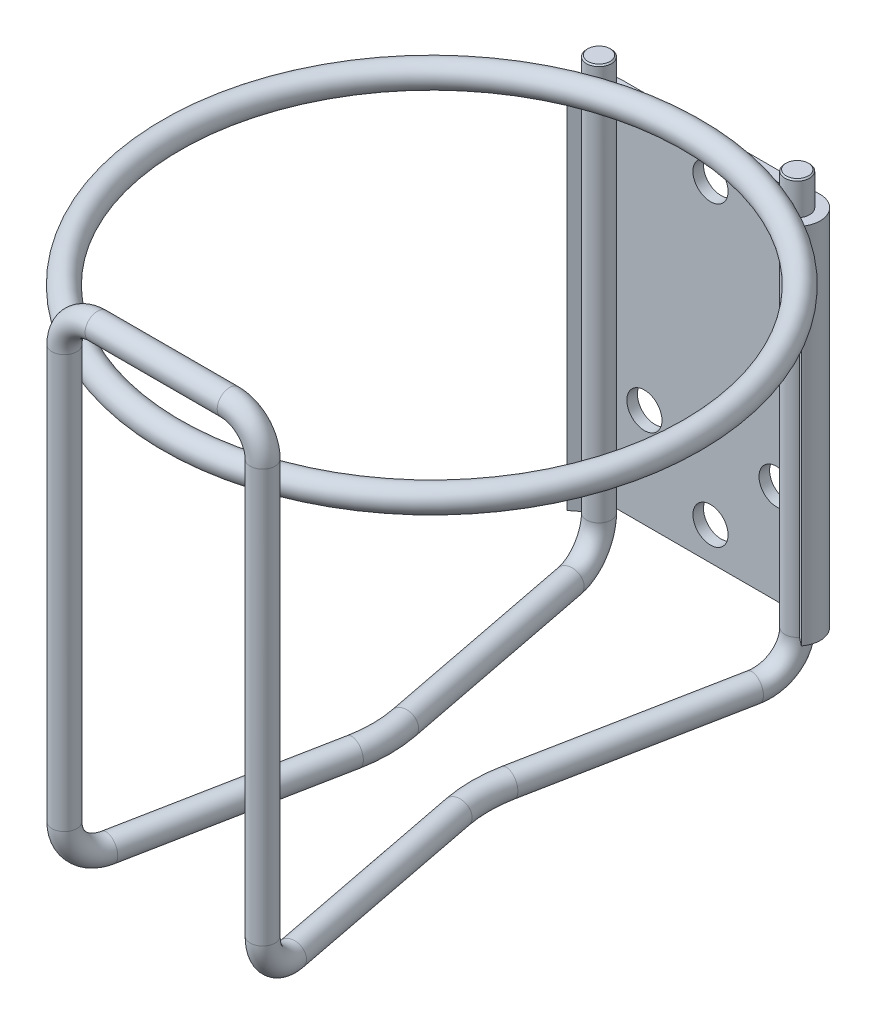
ISO-10303-21;
HEADER;
FILE_DESCRIPTION(('STEP AP214'),'2;1');
FILE_NAME('part.step','',(''),(''),'','','');
FILE_SCHEMA(('AUTOMOTIVE_DESIGN { 1 0 10303 214 1 1 1 1 }'));
ENDSEC;
DATA;
#1=APPLICATION_CONTEXT('core data for automotive mechanical design processes');
#2=APPLICATION_PROTOCOL_DEFINITION('international standard','automotive_design',2000,#1);
#3=PRODUCT_CONTEXT('',#1,'mechanical');
#4=PRODUCT('Part','Part','',(#3));
#5=PRODUCT_RELATED_PRODUCT_CATEGORY('part','',(#4));
#6=PRODUCT_DEFINITION_FORMATION('','',#4);
#7=PRODUCT_DEFINITION_CONTEXT('part definition',#1,'design');
#8=PRODUCT_DEFINITION('design','',#6,#7);
#9=PRODUCT_DEFINITION_SHAPE('','',#8);
#10=(LENGTH_UNIT() NAMED_UNIT(*) SI_UNIT(.MILLI.,.METRE.));
#11=(NAMED_UNIT(*) PLANE_ANGLE_UNIT() SI_UNIT($,.RADIAN.));
#12=(NAMED_UNIT(*) SI_UNIT($,.STERADIAN.) SOLID_ANGLE_UNIT());
#13=UNCERTAINTY_MEASURE_WITH_UNIT(LENGTH_MEASURE(1.E-05),#10,'distance_accuracy_value','');
#14=(GEOMETRIC_REPRESENTATION_CONTEXT(3) GLOBAL_UNCERTAINTY_ASSIGNED_CONTEXT((#13)) GLOBAL_UNIT_ASSIGNED_CONTEXT((#10,
#11,#12)) REPRESENTATION_CONTEXT('',''));
#15=CARTESIAN_POINT('',(0.,0.,0.));
#16=DIRECTION('',(0.,0.,1.));
#17=DIRECTION('',(1.,0.,0.));
#18=AXIS2_PLACEMENT_3D('',#15,#16,#17);
#19=CARTESIAN_POINT('',(19.05,-34.925,-2.032));
#20=DIRECTION('',(0.,-1.,0.));
#21=DIRECTION('',(1.,0.,0.));
#22=AXIS2_PLACEMENT_3D('',#19,#20,#21);
#23=PLANE('',#22);
#24=CARTESIAN_POINT('',(-19.05,-34.925,2.38125));
#25=DIRECTION('',(0.,-1.,0.));
#26=DIRECTION('',(1.,0.,0.));
#27=AXIS2_PLACEMENT_3D('',#24,#25,#26);
#28=CIRCLE('',#27,2.38125);
#29=CARTESIAN_POINT('',(-20.9341309422067,-34.925,3.83741007194245));
#30=VERTEX_POINT('',#29);
#31=CARTESIAN_POINT('',(-19.05,-34.925,0.));
#32=VERTEX_POINT('',#31);
#33=EDGE_CURVE('E12',#30,#32,#28,.T.);
#34=ORIENTED_EDGE('',*,*,#33,.F.);
#35=DIRECTION('',(0.791236091215398,0.,-0.611510791366906));
#36=VECTOR('',#35,1.);
#37=CARTESIAN_POINT('',(-20.9341309422067,-34.925,3.83741007194245));
#38=LINE('',#37,#36);
#39=CARTESIAN_POINT('',(-22.5419226795564,-34.925,5.08));
#40=VERTEX_POINT('',#39);
#41=EDGE_CURVE('E131',#40,#30,#38,.T.);
#42=ORIENTED_EDGE('',*,*,#41,.F.);
#43=CARTESIAN_POINT('',(-19.05,-34.925,2.38125000000001));
#44=DIRECTION('',(0.,-1.,0.));
#45=DIRECTION('',(1.,0.,0.));
#46=AXIS2_PLACEMENT_3D('',#43,#44,#45);
#47=CIRCLE('',#46,4.41325000000001);
#48=CARTESIAN_POINT('',(-19.05,-34.925,-2.032));
#49=VERTEX_POINT('',#48);
#50=EDGE_CURVE('E125',#49,#40,#47,.F.);
#51=ORIENTED_EDGE('',*,*,#50,.F.);
#52=DIRECTION('',(1.,0.,0.));
#53=VECTOR('',#52,1.);
#54=CARTESIAN_POINT('',(19.05,-34.925,-2.032));
#55=LINE('',#54,#53);
#56=CARTESIAN_POINT('',(19.05,-34.925,-2.032));
#57=VERTEX_POINT('',#56);
#58=EDGE_CURVE('E119',#49,#57,#55,.T.);
#59=ORIENTED_EDGE('',*,*,#58,.T.);
#60=CARTESIAN_POINT('',(19.05,-34.925,2.38125000000001));
#61=DIRECTION('',(0.,1.,0.));
#62=DIRECTION('',(-1.,0.,0.));
#63=AXIS2_PLACEMENT_3D('',#60,#61,#62);
#64=CIRCLE('',#63,4.41325000000001);
#65=CARTESIAN_POINT('',(22.5419226795564,-34.925,5.08));
#66=VERTEX_POINT('',#65);
#67=EDGE_CURVE('E154',#57,#66,#64,.F.);
#68=ORIENTED_EDGE('',*,*,#67,.T.);
#69=DIRECTION('',(-0.791236091215398,0.,-0.611510791366906));
#70=VECTOR('',#69,1.);
#71=CARTESIAN_POINT('',(20.9341309422067,-34.925,3.83741007194245));
#72=LINE('',#71,#70);
#73=CARTESIAN_POINT('',(20.9341309422067,-34.925,3.83741007194245));
#74=VERTEX_POINT('',#73);
#75=EDGE_CURVE('E194',#66,#74,#72,.T.);
#76=ORIENTED_EDGE('',*,*,#75,.T.);
#77=CARTESIAN_POINT('',(19.05,-34.925,2.38125));
#78=DIRECTION('',(0.,1.,0.));
#79=DIRECTION('',(-1.,0.,0.));
#80=AXIS2_PLACEMENT_3D('',#77,#78,#79);
#81=CIRCLE('',#80,2.38125);
#82=CARTESIAN_POINT('',(19.05,-34.925,0.));
#83=VERTEX_POINT('',#82);
#84=EDGE_CURVE('E188',#74,#83,#81,.T.);
#85=ORIENTED_EDGE('',*,*,#84,.T.);
#86=DIRECTION('',(1.,0.,0.));
#87=VECTOR('',#86,1.);
#88=CARTESIAN_POINT('',(19.05,-34.925,0.));
#89=LINE('',#88,#87);
#90=EDGE_CURVE('E111',#32,#83,#89,.T.);
#91=ORIENTED_EDGE('',*,*,#90,.F.);
#92=EDGE_LOOP('',(#34,#42,#51,#59,#68,#76,#85,#91));
#93=FACE_BOUND('',#92,.T.);
#94=ADVANCED_FACE('F44',(#93),#23,.T.);
#95=CARTESIAN_POINT('',(-19.05,34.925,2.38125));
#96=DIRECTION('',(0.,1.,0.));
#97=DIRECTION('',(-1.,0.,0.));
#98=AXIS2_PLACEMENT_3D('',#95,#96,#97);
#99=PLANE('',#98);
#100=CARTESIAN_POINT('',(-19.05,34.925,2.38125));
#101=DIRECTION('',(0.,-1.,0.));
#102=DIRECTION('',(-1.,0.,0.));
#103=AXIS2_PLACEMENT_3D('',#100,#101,#102);
#104=CIRCLE('',#103,2.38125);
#105=CARTESIAN_POINT('',(-20.9341309422067,34.925,3.83741007194245));
#106=VERTEX_POINT('',#105);
#107=CARTESIAN_POINT('',(-19.05,34.925,0.));
#108=VERTEX_POINT('',#107);
#109=EDGE_CURVE('E117',#106,#108,#104,.T.);
#110=ORIENTED_EDGE('',*,*,#109,.T.);
#111=DIRECTION('',(-1.,0.,0.));
#112=VECTOR('',#111,1.);
#113=CARTESIAN_POINT('',(19.05,34.925,0.));
#114=LINE('',#113,#112);
#115=CARTESIAN_POINT('',(19.05,34.925,0.));
#116=VERTEX_POINT('',#115);
#117=EDGE_CURVE('E62',#116,#108,#114,.T.);
#118=ORIENTED_EDGE('',*,*,#117,.F.);
#119=CARTESIAN_POINT('',(19.05,34.925,2.38125));
#120=DIRECTION('',(0.,1.,0.));
#121=DIRECTION('',(1.,0.,0.));
#122=AXIS2_PLACEMENT_3D('',#119,#120,#121);
#123=CIRCLE('',#122,2.38125);
#124=CARTESIAN_POINT('',(20.9341309422067,34.925,3.83741007194245));
#125=VERTEX_POINT('',#124);
#126=EDGE_CURVE('E96',#125,#116,#123,.T.);
#127=ORIENTED_EDGE('',*,*,#126,.F.);
#128=DIRECTION('',(-0.791236091215398,0.,-0.611510791366906));
#129=VECTOR('',#128,1.);
#130=CARTESIAN_POINT('',(20.9341309422067,34.925,3.83741007194245));
#131=LINE('',#130,#129);
#132=CARTESIAN_POINT('',(22.5419226795564,34.925,5.08));
#133=VERTEX_POINT('',#132);
#134=EDGE_CURVE('E197',#133,#125,#131,.T.);
#135=ORIENTED_EDGE('',*,*,#134,.F.);
#136=CARTESIAN_POINT('',(19.05,34.925,2.38125000000001));
#137=DIRECTION('',(0.,-1.,0.));
#138=DIRECTION('',(-1.,0.,0.));
#139=AXIS2_PLACEMENT_3D('',#136,#137,#138);
#140=CIRCLE('',#139,4.41325000000001);
#141=CARTESIAN_POINT('',(19.05,34.925,-2.032));
#142=VERTEX_POINT('',#141);
#143=EDGE_CURVE('E107',#142,#133,#140,.T.);
#144=ORIENTED_EDGE('',*,*,#143,.F.);
#145=DIRECTION('',(-1.,0.,0.));
#146=VECTOR('',#145,1.);
#147=CARTESIAN_POINT('',(19.05,34.925,-2.032));
#148=LINE('',#147,#146);
#149=CARTESIAN_POINT('',(-19.05,34.925,-2.032));
#150=VERTEX_POINT('',#149);
#151=EDGE_CURVE('E129',#142,#150,#148,.T.);
#152=ORIENTED_EDGE('',*,*,#151,.T.);
#153=CARTESIAN_POINT('',(-19.05,34.925,2.38125000000001));
#154=DIRECTION('',(0.,1.,0.));
#155=DIRECTION('',(1.,0.,0.));
#156=AXIS2_PLACEMENT_3D('',#153,#154,#155);
#157=CIRCLE('',#156,4.41325000000001);
#158=CARTESIAN_POINT('',(-22.5419226795564,34.925,5.08));
#159=VERTEX_POINT('',#158);
#160=EDGE_CURVE('E126',#150,#159,#157,.T.);
#161=ORIENTED_EDGE('',*,*,#160,.T.);
#162=DIRECTION('',(0.791236091215398,0.,-0.611510791366906));
#163=VECTOR('',#162,1.);
#164=CARTESIAN_POINT('',(-20.9341309422067,34.925,3.83741007194245));
#165=LINE('',#164,#163);
#166=EDGE_CURVE('E123',#159,#106,#165,.T.);
#167=ORIENTED_EDGE('',*,*,#166,.T.);
#168=EDGE_LOOP('',(#110,#118,#127,#135,#144,#152,#161,#167));
#169=FACE_BOUND('',#168,.T.);
#170=ADVANCED_FACE('F114',(#169),#99,.T.);
#171=CARTESIAN_POINT('',(-19.05,-43.2950250634332,2.38125000000001));
#172=DIRECTION('',(0.,1.,0.));
#173=DIRECTION('',(-1.,0.,0.));
#174=AXIS2_PLACEMENT_3D('',#171,#172,#173);
#175=CYLINDRICAL_SURFACE('',#174,4.41325000000001);
#176=DIRECTION('',(0.,-1.,0.));
#177=VECTOR('',#176,1.);
#178=CARTESIAN_POINT('',(-19.05,-34.925,-2.032));
#179=LINE('',#178,#177);
#180=EDGE_CURVE('E82',#150,#49,#179,.T.);
#181=ORIENTED_EDGE('',*,*,#180,.T.);
#182=ORIENTED_EDGE('',*,*,#50,.T.);
#183=DIRECTION('',(0.,1.,0.));
#184=VECTOR('',#183,1.);
#185=CARTESIAN_POINT('',(-22.5419226795564,-43.2950250634332,5.08));
#186=LINE('',#185,#184);
#187=EDGE_CURVE('E47',#40,#159,#186,.T.);
#188=ORIENTED_EDGE('',*,*,#187,.T.);
#189=ORIENTED_EDGE('',*,*,#160,.F.);
#190=EDGE_LOOP('',(#181,#182,#188,#189));
#191=FACE_BOUND('',#190,.T.);
#192=ADVANCED_FACE('F146',(#191),#175,.T.);
#193=CARTESIAN_POINT('',(-20.9341309422067,-43.2950250634332,3.83741007194245));
#194=DIRECTION('',(0.611510791366906,0.,0.791236091215398));
#195=DIRECTION('',(0.791236091215398,0.,-0.611510791366906));
#196=AXIS2_PLACEMENT_3D('',#193,#194,#195);
#197=PLANE('',#196);
#198=ORIENTED_EDGE('',*,*,#187,.F.);
#199=ORIENTED_EDGE('',*,*,#41,.T.);
#200=DIRECTION('',(0.,1.,0.));
#201=VECTOR('',#200,1.);
#202=CARTESIAN_POINT('',(-20.9341309422067,-43.2950250634332,3.83741007194245));
#203=LINE('',#202,#201);
#204=EDGE_CURVE('E53',#30,#106,#203,.T.);
#205=ORIENTED_EDGE('',*,*,#204,.T.);
#206=ORIENTED_EDGE('',*,*,#166,.F.);
#207=EDGE_LOOP('',(#198,#199,#205,#206));
#208=FACE_BOUND('',#207,.T.);
#209=ADVANCED_FACE('F138',(#208),#197,.T.);
#210=CARTESIAN_POINT('',(-19.05,-43.2950250634332,2.38125));
#211=DIRECTION('',(0.,1.,0.));
#212=DIRECTION('',(-1.,0.,0.));
#213=AXIS2_PLACEMENT_3D('',#210,#211,#212);
#214=CYLINDRICAL_SURFACE('',#213,2.38125);
#215=ORIENTED_EDGE('',*,*,#204,.F.);
#216=ORIENTED_EDGE('',*,*,#33,.T.);
#217=DIRECTION('',(0.,-1.,0.));
#218=VECTOR('',#217,1.);
#219=CARTESIAN_POINT('',(-19.05,-34.925,0.));
#220=LINE('',#219,#218);
#221=EDGE_CURVE('E141',#108,#32,#220,.T.);
#222=ORIENTED_EDGE('',*,*,#221,.F.);
#223=ORIENTED_EDGE('',*,*,#109,.F.);
#224=EDGE_LOOP('',(#215,#216,#222,#223));
#225=FACE_BOUND('',#224,.T.);
#226=ADVANCED_FACE('F140',(#225),#214,.F.);
#227=CARTESIAN_POINT('',(0.,0.,-2.032));
#228=DIRECTION('',(0.,0.,1.));
#229=DIRECTION('',(1.,0.,0.));
#230=AXIS2_PLACEMENT_3D('',#227,#228,#229);
#231=PLANE('',#230);
#232=CARTESIAN_POINT('',(12.7,-15.875,-2.032));
#233=DIRECTION('',(0.,0.,1.));
#234=DIRECTION('',(1.,0.,0.));
#235=AXIS2_PLACEMENT_3D('',#232,#233,#234);
#236=CIRCLE('',#235,3.3782);
#237=CARTESIAN_POINT('',(16.0782,-15.875,-2.032));
#238=VERTEX_POINT('',#237);
#239=EDGE_CURVE('E182',#238,#238,#236,.T.);
#240=ORIENTED_EDGE('',*,*,#239,.T.);
#241=EDGE_LOOP('',(#240));
#242=FACE_BOUND('',#241,.T.);
#243=CARTESIAN_POINT('',(-12.7,-15.875,-2.032));
#244=DIRECTION('',(0.,0.,1.));
#245=DIRECTION('',(1.,0.,0.));
#246=AXIS2_PLACEMENT_3D('',#243,#244,#245);
#247=CIRCLE('',#246,3.3782);
#248=CARTESIAN_POINT('',(-9.3218,-15.875,-2.032));
#249=VERTEX_POINT('',#248);
#250=EDGE_CURVE('E176',#249,#249,#247,.T.);
#251=ORIENTED_EDGE('',*,*,#250,.T.);
#252=EDGE_LOOP('',(#251));
#253=FACE_BOUND('',#252,.T.);
#254=CARTESIAN_POINT('',(0.,-28.575,-2.032));
#255=DIRECTION('',(0.,0.,1.));
#256=DIRECTION('',(1.,0.,0.));
#257=AXIS2_PLACEMENT_3D('',#254,#255,#256);
#258=CIRCLE('',#257,3.37819999999999);
#259=CARTESIAN_POINT('',(3.3782,-28.575,-2.032));
#260=VERTEX_POINT('',#259);
#261=EDGE_CURVE('E171',#260,#260,#258,.T.);
#262=ORIENTED_EDGE('',*,*,#261,.T.);
#263=EDGE_LOOP('',(#262));
#264=FACE_BOUND('',#263,.T.);
#265=CARTESIAN_POINT('',(0.,28.575,-2.032));
#266=DIRECTION('',(0.,0.,1.));
#267=DIRECTION('',(1.,0.,0.));
#268=AXIS2_PLACEMENT_3D('',#265,#266,#267);
#269=CIRCLE('',#268,3.3782);
#270=CARTESIAN_POINT('',(3.3782,28.575,-2.032));
#271=VERTEX_POINT('',#270);
#272=EDGE_CURVE('E164',#271,#271,#269,.T.);
#273=ORIENTED_EDGE('',*,*,#272,.T.);
#274=EDGE_LOOP('',(#273));
#275=FACE_BOUND('',#274,.T.);
#276=ORIENTED_EDGE('',*,*,#180,.F.);
#277=ORIENTED_EDGE('',*,*,#151,.F.);
#278=DIRECTION('',(0.,1.,0.));
#279=VECTOR('',#278,1.);
#280=CARTESIAN_POINT('',(19.05,-34.925,-2.032));
#281=LINE('',#280,#279);
#282=EDGE_CURVE('E157',#57,#142,#281,.T.);
#283=ORIENTED_EDGE('',*,*,#282,.F.);
#284=ORIENTED_EDGE('',*,*,#58,.F.);
#285=EDGE_LOOP('',(#276,#277,#283,#284));
#286=FACE_BOUND('',#285,.T.);
#287=ADVANCED_FACE('F216',(#242,#253,#264,#275,#286),#231,.F.);
#288=CARTESIAN_POINT('',(0.,0.,0.));
#289=DIRECTION('',(0.,0.,1.));
#290=DIRECTION('',(1.,0.,0.));
#291=AXIS2_PLACEMENT_3D('',#288,#289,#290);
#292=PLANE('',#291);
#293=CARTESIAN_POINT('',(12.7,-15.875,0.));
#294=DIRECTION('',(0.,0.,1.));
#295=DIRECTION('',(1.,0.,0.));
#296=AXIS2_PLACEMENT_3D('',#293,#294,#295);
#297=CIRCLE('',#296,3.3782);
#298=CARTESIAN_POINT('',(16.0782,-15.875,0.));
#299=VERTEX_POINT('',#298);
#300=EDGE_CURVE('E185',#299,#299,#297,.T.);
#301=ORIENTED_EDGE('',*,*,#300,.F.);
#302=EDGE_LOOP('',(#301));
#303=FACE_BOUND('',#302,.T.);
#304=CARTESIAN_POINT('',(-12.7,-15.875,0.));
#305=DIRECTION('',(0.,0.,1.));
#306=DIRECTION('',(1.,0.,0.));
#307=AXIS2_PLACEMENT_3D('',#304,#305,#306);
#308=CIRCLE('',#307,3.3782);
#309=CARTESIAN_POINT('',(-9.3218,-15.875,0.));
#310=VERTEX_POINT('',#309);
#311=EDGE_CURVE('E179',#310,#310,#308,.T.);
#312=ORIENTED_EDGE('',*,*,#311,.F.);
#313=EDGE_LOOP('',(#312));
#314=FACE_BOUND('',#313,.T.);
#315=CARTESIAN_POINT('',(0.,-28.575,0.));
#316=DIRECTION('',(0.,0.,1.));
#317=DIRECTION('',(1.,0.,0.));
#318=AXIS2_PLACEMENT_3D('',#315,#316,#317);
#319=CIRCLE('',#318,3.37819999999999);
#320=CARTESIAN_POINT('',(3.3782,-28.575,0.));
#321=VERTEX_POINT('',#320);
#322=EDGE_CURVE('E173',#321,#321,#319,.T.);
#323=ORIENTED_EDGE('',*,*,#322,.F.);
#324=EDGE_LOOP('',(#323));
#325=FACE_BOUND('',#324,.T.);
#326=CARTESIAN_POINT('',(0.,28.575,0.));
#327=DIRECTION('',(0.,0.,1.));
#328=DIRECTION('',(1.,0.,0.));
#329=AXIS2_PLACEMENT_3D('',#326,#327,#328);
#330=CIRCLE('',#329,3.3782);
#331=CARTESIAN_POINT('',(3.3782,28.575,0.));
#332=VERTEX_POINT('',#331);
#333=EDGE_CURVE('E166',#332,#332,#330,.T.);
#334=ORIENTED_EDGE('',*,*,#333,.F.);
#335=EDGE_LOOP('',(#334));
#336=FACE_BOUND('',#335,.T.);
#337=ORIENTED_EDGE('',*,*,#221,.T.);
#338=ORIENTED_EDGE('',*,*,#90,.T.);
#339=DIRECTION('',(0.,1.,0.));
#340=VECTOR('',#339,1.);
#341=CARTESIAN_POINT('',(19.05,-34.925,0.));
#342=LINE('',#341,#340);
#343=EDGE_CURVE('E100',#83,#116,#342,.T.);
#344=ORIENTED_EDGE('',*,*,#343,.T.);
#345=ORIENTED_EDGE('',*,*,#117,.T.);
#346=EDGE_LOOP('',(#337,#338,#344,#345));
#347=FACE_BOUND('',#346,.T.);
#348=ADVANCED_FACE('F110',(#303,#314,#325,#336,#347),#292,.T.);
#349=CARTESIAN_POINT('',(0.,28.575,-2.032));
#350=DIRECTION('',(0.,0.,1.));
#351=DIRECTION('',(1.,0.,0.));
#352=AXIS2_PLACEMENT_3D('',#349,#350,#351);
#353=CYLINDRICAL_SURFACE('',#352,3.3782);
#354=ORIENTED_EDGE('',*,*,#272,.F.);
#355=EDGE_LOOP('',(#354));
#356=FACE_BOUND('',#355,.T.);
#357=ORIENTED_EDGE('',*,*,#333,.T.);
#358=EDGE_LOOP('',(#357));
#359=FACE_BOUND('',#358,.T.);
#360=ADVANCED_FACE('F224',(#356,#359),#353,.F.);
#361=CARTESIAN_POINT('',(0.,-28.575,-2.032));
#362=DIRECTION('',(0.,0.,1.));
#363=DIRECTION('',(1.,0.,0.));
#364=AXIS2_PLACEMENT_3D('',#361,#362,#363);
#365=CYLINDRICAL_SURFACE('',#364,3.37819999999999);
#366=ORIENTED_EDGE('',*,*,#261,.F.);
#367=EDGE_LOOP('',(#366));
#368=FACE_BOUND('',#367,.T.);
#369=ORIENTED_EDGE('',*,*,#322,.T.);
#370=EDGE_LOOP('',(#369));
#371=FACE_BOUND('',#370,.T.);
#372=ADVANCED_FACE('F266',(#368,#371),#365,.F.);
#373=CARTESIAN_POINT('',(-12.7,-15.875,-2.032));
#374=DIRECTION('',(0.,0.,1.));
#375=DIRECTION('',(1.,0.,0.));
#376=AXIS2_PLACEMENT_3D('',#373,#374,#375);
#377=CYLINDRICAL_SURFACE('',#376,3.3782);
#378=ORIENTED_EDGE('',*,*,#250,.F.);
#379=EDGE_LOOP('',(#378));
#380=FACE_BOUND('',#379,.T.);
#381=ORIENTED_EDGE('',*,*,#311,.T.);
#382=EDGE_LOOP('',(#381));
#383=FACE_BOUND('',#382,.T.);
#384=ADVANCED_FACE('F274',(#380,#383),#377,.F.);
#385=CARTESIAN_POINT('',(12.7,-15.875,-2.032));
#386=DIRECTION('',(0.,0.,1.));
#387=DIRECTION('',(1.,0.,0.));
#388=AXIS2_PLACEMENT_3D('',#385,#386,#387);
#389=CYLINDRICAL_SURFACE('',#388,3.3782);
#390=ORIENTED_EDGE('',*,*,#239,.F.);
#391=EDGE_LOOP('',(#390));
#392=FACE_BOUND('',#391,.T.);
#393=ORIENTED_EDGE('',*,*,#300,.T.);
#394=EDGE_LOOP('',(#393));
#395=FACE_BOUND('',#394,.T.);
#396=ADVANCED_FACE('F283',(#392,#395),#389,.F.);
#397=CARTESIAN_POINT('',(19.05,-43.2950250634332,2.38125000000001));
#398=DIRECTION('',(0.,1.,0.));
#399=DIRECTION('',(1.,0.,0.));
#400=AXIS2_PLACEMENT_3D('',#397,#398,#399);
#401=CYLINDRICAL_SURFACE('',#400,4.41325000000001);
#402=ORIENTED_EDGE('',*,*,#282,.T.);
#403=ORIENTED_EDGE('',*,*,#143,.T.);
#404=DIRECTION('',(0.,1.,0.));
#405=VECTOR('',#404,1.);
#406=CARTESIAN_POINT('',(22.5419226795564,-43.2950250634332,5.08));
#407=LINE('',#406,#405);
#408=EDGE_CURVE('E191',#66,#133,#407,.T.);
#409=ORIENTED_EDGE('',*,*,#408,.F.);
#410=ORIENTED_EDGE('',*,*,#67,.F.);
#411=EDGE_LOOP('',(#402,#403,#409,#410));
#412=FACE_BOUND('',#411,.T.);
#413=ADVANCED_FACE('F215',(#412),#401,.T.);
#414=CARTESIAN_POINT('',(20.9341309422067,-43.2950250634332,3.83741007194245));
#415=DIRECTION('',(-0.611510791366906,0.,0.791236091215398));
#416=DIRECTION('',(-0.791236091215398,0.,-0.611510791366906));
#417=AXIS2_PLACEMENT_3D('',#414,#415,#416);
#418=PLANE('',#417);
#419=ORIENTED_EDGE('',*,*,#408,.T.);
#420=ORIENTED_EDGE('',*,*,#134,.T.);
#421=DIRECTION('',(0.,1.,0.));
#422=VECTOR('',#421,1.);
#423=CARTESIAN_POINT('',(20.9341309422067,-43.2950250634332,3.83741007194245));
#424=LINE('',#423,#422);
#425=EDGE_CURVE('E103',#74,#125,#424,.T.);
#426=ORIENTED_EDGE('',*,*,#425,.F.);
#427=ORIENTED_EDGE('',*,*,#75,.F.);
#428=EDGE_LOOP('',(#419,#420,#426,#427));
#429=FACE_BOUND('',#428,.T.);
#430=ADVANCED_FACE('F203',(#429),#418,.T.);
#431=CARTESIAN_POINT('',(19.05,-43.2950250634332,2.38125));
#432=DIRECTION('',(0.,1.,0.));
#433=DIRECTION('',(1.,0.,0.));
#434=AXIS2_PLACEMENT_3D('',#431,#432,#433);
#435=CYLINDRICAL_SURFACE('',#434,2.38125);
#436=ORIENTED_EDGE('',*,*,#425,.T.);
#437=ORIENTED_EDGE('',*,*,#126,.T.);
#438=ORIENTED_EDGE('',*,*,#343,.F.);
#439=ORIENTED_EDGE('',*,*,#84,.F.);
#440=EDGE_LOOP('',(#436,#437,#438,#439));
#441=FACE_BOUND('',#440,.T.);
#442=ADVANCED_FACE('F97',(#441),#435,.F.);
#443=CLOSED_SHELL('',(#94,#170,#192,#209,#226,#287,#348,#360,#372,#384,#396,#413,#430,#442));
#444=MANIFOLD_SOLID_BREP('B2',#443);
#445=CARTESIAN_POINT('',(0.,38.1,53.5636030228826));
#446=DIRECTION('',(0.,-1.,0.));
#447=DIRECTION('',(1.,0.,0.));
#448=AXIS2_PLACEMENT_3D('',#445,#446,#447);
#449=TOROIDAL_SURFACE('',#448,50.00625,2.38125);
#450=CARTESIAN_POINT('',(52.3875,38.1,53.5636030228826));
#451=VERTEX_POINT('',#450);
#452=VERTEX_LOOP('',#451);
#453=FACE_BOUND('',#452,.T.);
#454=ADVANCED_FACE('F388',(#453),#449,.T.);
#455=CLOSED_SHELL('',(#454));
#456=MANIFOLD_SOLID_BREP('B6',#455);
#457=CARTESIAN_POINT('',(19.0500000000001,-34.925,105.12425));
#458=DIRECTION('',(0.,1.,0.));
#459=DIRECTION('',(0.,0.,-1.));
#460=AXIS2_PLACEMENT_3D('',#457,#458,#459);
#461=CYLINDRICAL_SURFACE('',#460,2.38125);
#462=CARTESIAN_POINT('',(19.0500000000001,-34.925,105.12425));
#463=DIRECTION('',(0.,1.,0.));
#464=DIRECTION('',(0.,0.,1.));
#465=AXIS2_PLACEMENT_3D('',#462,#463,#464);
#466=CIRCLE('',#465,2.38125);
#467=CARTESIAN_POINT('',(19.5050802285386,-34.925,107.461610380449));
#468=VERTEX_POINT('',#467);
#469=EDGE_CURVE('E430',#468,#468,#466,.T.);
#470=ORIENTED_EDGE('',*,*,#469,.T.);
#471=EDGE_LOOP('',(#470));
#472=FACE_BOUND('',#471,.T.);
#473=CARTESIAN_POINT('',(19.05,44.4500000000001,105.12425));
#474=DIRECTION('',(0.,1.,0.));
#475=DIRECTION('',(0.,0.,1.));
#476=AXIS2_PLACEMENT_3D('',#473,#474,#475);
#477=CIRCLE('',#476,2.38125);
#478=CARTESIAN_POINT('',(21.43125,44.4500000000002,105.12425));
#479=VERTEX_POINT('',#478);
#480=EDGE_CURVE('E448',#479,#479,#477,.T.);
#481=ORIENTED_EDGE('',*,*,#480,.F.);
#482=EDGE_LOOP('',(#481));
#483=FACE_BOUND('',#482,.T.);
#484=ADVANCED_FACE('F401',(#472,#483),#461,.T.);
#485=CARTESIAN_POINT('',(19.05,-34.925,2.38124999999999));
#486=DIRECTION('',(0.,1.,0.));
#487=DIRECTION('',(0.,0.,1.));
#488=AXIS2_PLACEMENT_3D('',#485,#486,#487);
#489=CYLINDRICAL_SURFACE('',#488,2.38125);
#490=CARTESIAN_POINT('',(19.05,41.0210000000001,2.38125));
#491=DIRECTION('',(0.,-1.,0.));
#492=DIRECTION('',(0.,0.,-1.));
#493=AXIS2_PLACEMENT_3D('',#490,#491,#492);
#494=CIRCLE('',#493,2.38125);
#495=CARTESIAN_POINT('',(19.05,41.0210000000001,0.));
#496=VERTEX_POINT('',#495);
#497=EDGE_CURVE('E408',#496,#496,#494,.T.);
#498=ORIENTED_EDGE('',*,*,#497,.T.);
#499=EDGE_LOOP('',(#498));
#500=FACE_BOUND('',#499,.T.);
#501=CARTESIAN_POINT('',(19.05,-34.925,2.38124999999999));
#502=DIRECTION('',(0.,-1.,0.));
#503=DIRECTION('',(0.,0.,-1.));
#504=AXIS2_PLACEMENT_3D('',#501,#502,#503);
#505=CIRCLE('',#504,2.38125);
#506=CARTESIAN_POINT('',(19.5050802285386,-34.925,0.0438896195508603));
#507=VERTEX_POINT('',#506);
#508=EDGE_CURVE('E421',#507,#507,#505,.T.);
#509=ORIENTED_EDGE('',*,*,#508,.F.);
#510=EDGE_LOOP('',(#509));
#511=FACE_BOUND('',#510,.T.);
#512=ADVANCED_FACE('F503',(#500,#511),#489,.T.);
#513=CARTESIAN_POINT('',(19.05,41.275,2.38125));
#514=DIRECTION('',(0.,-1.,0.));
#515=DIRECTION('',(0.,0.,-1.));
#516=AXIS2_PLACEMENT_3D('',#513,#514,#515);
#517=PLANE('',#516);
#518=CARTESIAN_POINT('',(19.05,41.275,2.38125));
#519=DIRECTION('',(0.,-1.,0.));
#520=DIRECTION('',(0.,0.,-1.));
#521=AXIS2_PLACEMENT_3D('',#518,#519,#520);
#522=CIRCLE('',#521,2.12725000000004);
#523=CARTESIAN_POINT('',(19.05,41.275,0.253999999999961));
#524=VERTEX_POINT('',#523);
#525=EDGE_CURVE('E387',#524,#524,#522,.F.);
#526=ORIENTED_EDGE('',*,*,#525,.T.);
#527=EDGE_LOOP('',(#526));
#528=FACE_BOUND('',#527,.T.);
#529=ADVANCED_FACE('F509',(#528),#517,.F.);
#530=CARTESIAN_POINT('',(17.6847593143842,-34.925,9.39333114134739));
#531=DIRECTION('',(0.981568663705668,0.,0.191109807260301));
#532=DIRECTION('',(0.191109807260301,0.,-0.981568663705668));
#533=AXIS2_PLACEMENT_3D('',#530,#531,#532);
#534=TOROIDAL_SURFACE('',#533,7.14375000000004,2.38125);
#535=CARTESIAN_POINT('',(17.6847593143842,-42.06875,9.39333114134739));
#536=DIRECTION('',(-0.191109807260301,0.,0.981568663705668));
#537=DIRECTION('',(-0.187587398133541,-0.981568663705668,-0.0365229584310691));
#538=AXIS2_PLACEMENT_3D('',#535,#536,#537);
#539=CIRCLE('',#538,2.38125);
#540=CARTESIAN_POINT('',(17.6847593143842,-44.45,9.39333114134739));
#541=VERTEX_POINT('',#540);
#542=EDGE_CURVE('E424',#541,#541,#539,.T.);
#543=CARTESIAN_POINT('',(17.6847593143842,-34.925,9.39333114134739));
#544=DIRECTION('',(0.981568663705668,0.,0.191109807260301));
#545=DIRECTION('',(0.191109807260301,0.,-0.981568663705668));
#546=AXIS2_PLACEMENT_3D('',#543,#544,#545);
#547=CIRCLE('',#546,9.52500000000004);
#548=EDGE_CURVE('',#541,#507,#547,.T.);
#549=ORIENTED_EDGE('',*,*,#542,.F.);
#550=ORIENTED_EDGE('',*,*,#508,.T.);
#551=ORIENTED_EDGE('',*,*,#548,.T.);
#552=ORIENTED_EDGE('',*,*,#548,.F.);
#553=EDGE_LOOP('',(#549,#551,#550,#552));
#554=FACE_BOUND('',#553,.T.);
#555=ADVANCED_FACE('F521',(#554),#534,.T.);
#556=CARTESIAN_POINT('',(34.925,-42.06875,53.75275));
#557=DIRECTION('',(0.,1.,0.));
#558=DIRECTION('',(0.,0.,1.));
#559=AXIS2_PLACEMENT_3D('',#556,#557,#558);
#560=TOROIDAL_SURFACE('',#559,25.4,2.38125000000001);
#561=CARTESIAN_POINT('',(9.99315594187606,-42.06875,48.8985608955883));
#562=DIRECTION('',(-0.191109807260301,0.,0.981568663705668));
#563=DIRECTION('',(0.981568663705668,0.,0.191109807260301));
#564=AXIS2_PLACEMENT_3D('',#561,#562,#563);
#565=CIRCLE('',#564,2.38125000000001);
#566=CARTESIAN_POINT('',(7.65579556142693,-42.06875,48.4434806670498));
#567=VERTEX_POINT('',#566);
#568=EDGE_CURVE('E427',#567,#567,#565,.T.);
#569=CARTESIAN_POINT('',(9.99315594187606,-42.06875,58.6069391044116));
#570=DIRECTION('',(0.191109807260301,0.,0.981568663705668));
#571=DIRECTION('',(0.981568663705668,0.,-0.191109807260301));
#572=AXIS2_PLACEMENT_3D('',#569,#570,#571);
#573=CIRCLE('',#572,2.38125000000001);
#574=CARTESIAN_POINT('',(7.65579556142692,-42.06875,59.0620193329502));
#575=VERTEX_POINT('',#574);
#576=EDGE_CURVE('E436',#575,#575,#573,.T.);
#577=CARTESIAN_POINT('',(34.925,-42.06875,53.75275));
#578=DIRECTION('',(0.,1.,0.));
#579=DIRECTION('',(0.,0.,1.));
#580=AXIS2_PLACEMENT_3D('',#577,#578,#579);
#581=CIRCLE('',#580,27.78125);
#582=EDGE_CURVE('',#567,#575,#581,.T.);
#583=ORIENTED_EDGE('',*,*,#568,.T.);
#584=ORIENTED_EDGE('',*,*,#576,.F.);
#585=ORIENTED_EDGE('',*,*,#582,.T.);
#586=ORIENTED_EDGE('',*,*,#582,.F.);
#587=EDGE_LOOP('',(#583,#585,#584,#586));
#588=FACE_BOUND('',#587,.T.);
#589=ADVANCED_FACE('F517',(#588),#560,.T.);
#590=CARTESIAN_POINT('',(9.99315594187606,-42.06875,48.8985608955883));
#591=DIRECTION('',(0.1911098072603,0.,-0.981568663705668));
#592=DIRECTION('',(-0.981568663705668,0.,-0.1911098072603));
#593=AXIS2_PLACEMENT_3D('',#590,#591,#592);
#594=CYLINDRICAL_SURFACE('',#593,2.38125000000001);
#595=ORIENTED_EDGE('',*,*,#568,.F.);
#596=EDGE_LOOP('',(#595));
#597=FACE_BOUND('',#596,.T.);
#598=ORIENTED_EDGE('',*,*,#542,.T.);
#599=EDGE_LOOP('',(#598));
#600=FACE_BOUND('',#599,.T.);
#601=ADVANCED_FACE('F514',(#597,#600),#594,.T.);
#602=CARTESIAN_POINT('',(17.6847593143843,-34.925,98.1121688586526));
#603=DIRECTION('',(0.981568663705668,0.,-0.191109807260301));
#604=DIRECTION('',(0.191109807260301,0.,0.981568663705668));
#605=AXIS2_PLACEMENT_3D('',#602,#603,#604);
#606=TOROIDAL_SURFACE('',#605,7.14375000000004,2.38125);
#607=CARTESIAN_POINT('',(17.6847593143843,-42.06875,98.1121688586526));
#608=DIRECTION('',(0.191109807260301,0.,0.981568663705668));
#609=DIRECTION('',(-0.187587398133541,-0.981568663705668,0.0365229584310695));
#610=AXIS2_PLACEMENT_3D('',#607,#608,#609);
#611=CIRCLE('',#610,2.38125);
#612=CARTESIAN_POINT('',(17.6847593143843,-44.45,98.1121688586526));
#613=VERTEX_POINT('',#612);
#614=EDGE_CURVE('E433',#613,#613,#611,.T.);
#615=CARTESIAN_POINT('',(17.6847593143843,-34.925,98.1121688586526));
#616=DIRECTION('',(0.981568663705668,0.,-0.191109807260301));
#617=DIRECTION('',(0.191109807260301,0.,0.981568663705668));
#618=AXIS2_PLACEMENT_3D('',#615,#616,#617);
#619=CIRCLE('',#618,9.52500000000004);
#620=EDGE_CURVE('',#468,#613,#619,.T.);
#621=ORIENTED_EDGE('',*,*,#469,.F.);
#622=ORIENTED_EDGE('',*,*,#614,.T.);
#623=ORIENTED_EDGE('',*,*,#620,.T.);
#624=ORIENTED_EDGE('',*,*,#620,.F.);
#625=EDGE_LOOP('',(#621,#623,#622,#624));
#626=FACE_BOUND('',#625,.T.);
#627=ADVANCED_FACE('F499',(#626),#606,.T.);
#628=CARTESIAN_POINT('',(9.99315594187606,-42.06875,58.6069391044116));
#629=DIRECTION('',(0.191109807260301,0.,0.981568663705668));
#630=DIRECTION('',(-0.981568663705668,0.,0.191109807260301));
#631=AXIS2_PLACEMENT_3D('',#628,#629,#630);
#632=CYLINDRICAL_SURFACE('',#631,2.38125000000001);
#633=ORIENTED_EDGE('',*,*,#576,.T.);
#634=EDGE_LOOP('',(#633));
#635=FACE_BOUND('',#634,.T.);
#636=ORIENTED_EDGE('',*,*,#614,.F.);
#637=EDGE_LOOP('',(#636));
#638=FACE_BOUND('',#637,.T.);
#639=ADVANCED_FACE('F489',(#635,#638),#632,.T.);
#640=CARTESIAN_POINT('',(-19.05,44.4499999999999,105.12425));
#641=DIRECTION('',(0.,-1.,0.));
#642=DIRECTION('',(0.,0.,-1.));
#643=AXIS2_PLACEMENT_3D('',#640,#641,#642);
#644=CYLINDRICAL_SURFACE('',#643,2.38125);
#645=CARTESIAN_POINT('',(-19.05,44.4499999999999,105.12425));
#646=DIRECTION('',(0.,-1.,0.));
#647=DIRECTION('',(0.,0.,1.));
#648=AXIS2_PLACEMENT_3D('',#645,#646,#647);
#649=CIRCLE('',#648,2.38125);
#650=CARTESIAN_POINT('',(-21.43125,44.4499999999999,105.12425));
#651=VERTEX_POINT('',#650);
#652=EDGE_CURVE('E439',#651,#651,#649,.T.);
#653=ORIENTED_EDGE('',*,*,#652,.T.);
#654=EDGE_LOOP('',(#653));
#655=FACE_BOUND('',#654,.T.);
#656=CARTESIAN_POINT('',(-19.0500000000001,-34.925,105.12425));
#657=DIRECTION('',(0.,-1.,0.));
#658=DIRECTION('',(0.,0.,1.));
#659=AXIS2_PLACEMENT_3D('',#656,#657,#658);
#660=CIRCLE('',#659,2.38125);
#661=CARTESIAN_POINT('',(-19.5050802285386,-34.925,107.461610380449));
#662=VERTEX_POINT('',#661);
#663=EDGE_CURVE('E460',#662,#662,#660,.T.);
#664=ORIENTED_EDGE('',*,*,#663,.F.);
#665=EDGE_LOOP('',(#664));
#666=FACE_BOUND('',#665,.T.);
#667=ADVANCED_FACE('F486',(#655,#666),#644,.T.);
#668=CARTESIAN_POINT('',(-12.7,44.45,105.12425));
#669=DIRECTION('',(0.,0.,1.));
#670=DIRECTION('',(1.,0.,0.));
#671=AXIS2_PLACEMENT_3D('',#668,#669,#670);
#672=TOROIDAL_SURFACE('',#671,6.35000000000003,2.38125);
#673=CARTESIAN_POINT('',(-12.7000000000001,50.8,105.12425));
#674=DIRECTION('',(-1.,0.,0.));
#675=DIRECTION('',(0.,0.,1.));
#676=AXIS2_PLACEMENT_3D('',#673,#674,#675);
#677=CIRCLE('',#676,2.38125);
#678=CARTESIAN_POINT('',(-12.7000000000001,53.18125,105.12425));
#679=VERTEX_POINT('',#678);
#680=EDGE_CURVE('E442',#679,#679,#677,.T.);
#681=CARTESIAN_POINT('',(-12.7,44.45,105.12425));
#682=DIRECTION('',(0.,0.,1.));
#683=DIRECTION('',(1.,0.,0.));
#684=AXIS2_PLACEMENT_3D('',#681,#682,#683);
#685=CIRCLE('',#684,8.73125000000003);
#686=EDGE_CURVE('',#679,#651,#685,.T.);
#687=ORIENTED_EDGE('',*,*,#680,.T.);
#688=ORIENTED_EDGE('',*,*,#652,.F.);
#689=ORIENTED_EDGE('',*,*,#686,.T.);
#690=ORIENTED_EDGE('',*,*,#686,.F.);
#691=EDGE_LOOP('',(#687,#689,#688,#690));
#692=FACE_BOUND('',#691,.T.);
#693=ADVANCED_FACE('F488',(#692),#672,.T.);
#694=CARTESIAN_POINT('',(12.6999999999999,50.8,105.12425));
#695=DIRECTION('',(-1.,0.,0.));
#696=DIRECTION('',(0.,0.,1.));
#697=AXIS2_PLACEMENT_3D('',#694,#695,#696);
#698=CYLINDRICAL_SURFACE('',#697,2.38125);
#699=CARTESIAN_POINT('',(12.6999999999999,50.8,105.12425));
#700=DIRECTION('',(-1.,0.,0.));
#701=DIRECTION('',(0.,0.,1.));
#702=AXIS2_PLACEMENT_3D('',#699,#700,#701);
#703=CIRCLE('',#702,2.38125);
#704=CARTESIAN_POINT('',(12.6999999999999,53.18125,105.12425));
#705=VERTEX_POINT('',#704);
#706=EDGE_CURVE('E445',#705,#705,#703,.T.);
#707=ORIENTED_EDGE('',*,*,#706,.T.);
#708=EDGE_LOOP('',(#707));
#709=FACE_BOUND('',#708,.T.);
#710=ORIENTED_EDGE('',*,*,#680,.F.);
#711=EDGE_LOOP('',(#710));
#712=FACE_BOUND('',#711,.T.);
#713=ADVANCED_FACE('F496',(#709,#712),#698,.T.);
#714=CARTESIAN_POINT('',(12.7,44.45,105.12425));
#715=DIRECTION('',(0.,0.,1.));
#716=DIRECTION('',(1.,0.,0.));
#717=AXIS2_PLACEMENT_3D('',#714,#715,#716);
#718=TOROIDAL_SURFACE('',#717,6.35000000000003,2.38125);
#719=CARTESIAN_POINT('',(12.7,44.45,105.12425));
#720=DIRECTION('',(0.,0.,1.));
#721=DIRECTION('',(1.,0.,0.));
#722=AXIS2_PLACEMENT_3D('',#719,#720,#721);
#723=CIRCLE('',#722,8.73125000000004);
#724=EDGE_CURVE('',#479,#705,#723,.T.);
#725=ORIENTED_EDGE('',*,*,#480,.T.);
#726=ORIENTED_EDGE('',*,*,#706,.F.);
#727=ORIENTED_EDGE('',*,*,#724,.T.);
#728=ORIENTED_EDGE('',*,*,#724,.F.);
#729=EDGE_LOOP('',(#725,#727,#726,#728));
#730=FACE_BOUND('',#729,.T.);
#731=ADVANCED_FACE('F548',(#730),#718,.T.);
#732=CARTESIAN_POINT('',(-19.05,-34.925,2.38124999999999));
#733=DIRECTION('',(0.,1.,0.));
#734=DIRECTION('',(0.,0.,1.));
#735=AXIS2_PLACEMENT_3D('',#732,#733,#734);
#736=CYLINDRICAL_SURFACE('',#735,2.38125);
#737=CARTESIAN_POINT('',(-19.05,41.021,2.38125));
#738=DIRECTION('',(0.,-1.,0.));
#739=DIRECTION('',(0.,0.,-1.));
#740=AXIS2_PLACEMENT_3D('',#737,#738,#739);
#741=CIRCLE('',#740,2.38125);
#742=CARTESIAN_POINT('',(-19.05,41.021,0.));
#743=VERTEX_POINT('',#742);
#744=EDGE_CURVE('E412',#743,#743,#741,.T.);
#745=ORIENTED_EDGE('',*,*,#744,.T.);
#746=EDGE_LOOP('',(#745));
#747=FACE_BOUND('',#746,.T.);
#748=CARTESIAN_POINT('',(-19.05,-34.925,2.38124999999999));
#749=DIRECTION('',(0.,1.,0.));
#750=DIRECTION('',(0.,0.,-1.));
#751=AXIS2_PLACEMENT_3D('',#748,#749,#750);
#752=CIRCLE('',#751,2.38125);
#753=CARTESIAN_POINT('',(-19.5050802285386,-34.925,0.0438896195508603));
#754=VERTEX_POINT('',#753);
#755=EDGE_CURVE('E451',#754,#754,#752,.T.);
#756=ORIENTED_EDGE('',*,*,#755,.T.);
#757=EDGE_LOOP('',(#756));
#758=FACE_BOUND('',#757,.T.);
#759=ADVANCED_FACE('F540',(#747,#758),#736,.T.);
#760=CARTESIAN_POINT('',(-19.05,41.275,2.38125));
#761=DIRECTION('',(0.,-1.,0.));
#762=DIRECTION('',(0.,0.,-1.));
#763=AXIS2_PLACEMENT_3D('',#760,#761,#762);
#764=PLANE('',#763);
#765=CARTESIAN_POINT('',(-19.05,41.275,2.38125));
#766=DIRECTION('',(0.,-1.,0.));
#767=DIRECTION('',(0.,0.,-1.));
#768=AXIS2_PLACEMENT_3D('',#765,#766,#767);
#769=CIRCLE('',#768,2.12725000000003);
#770=CARTESIAN_POINT('',(-19.05,41.275,0.253999999999975));
#771=VERTEX_POINT('',#770);
#772=EDGE_CURVE('E416',#771,#771,#769,.F.);
#773=ORIENTED_EDGE('',*,*,#772,.T.);
#774=EDGE_LOOP('',(#773));
#775=FACE_BOUND('',#774,.T.);
#776=ADVANCED_FACE('F537',(#775),#764,.F.);
#777=CARTESIAN_POINT('',(-17.6847593143842,-34.925,9.39333114134739));
#778=DIRECTION('',(-0.981568663705668,0.,0.191109807260301));
#779=DIRECTION('',(-0.191109807260301,0.,-0.981568663705668));
#780=AXIS2_PLACEMENT_3D('',#777,#778,#779);
#781=TOROIDAL_SURFACE('',#780,7.14375000000004,2.38125);
#782=CARTESIAN_POINT('',(-17.6847593143842,-42.06875,9.39333114134739));
#783=DIRECTION('',(-0.191109807260301,0.,-0.981568663705668));
#784=DIRECTION('',(0.187587398133541,-0.981568663705668,-0.0365229584310691));
#785=AXIS2_PLACEMENT_3D('',#782,#783,#784);
#786=CIRCLE('',#785,2.38125);
#787=CARTESIAN_POINT('',(-17.6847593143842,-44.45,9.39333114134739));
#788=VERTEX_POINT('',#787);
#789=EDGE_CURVE('E454',#788,#788,#786,.T.);
#790=CARTESIAN_POINT('',(-17.6847593143842,-34.925,9.39333114134739));
#791=DIRECTION('',(-0.981568663705668,0.,0.191109807260301));
#792=DIRECTION('',(-0.191109807260301,0.,-0.981568663705668));
#793=AXIS2_PLACEMENT_3D('',#790,#791,#792);
#794=CIRCLE('',#793,9.52500000000004);
#795=EDGE_CURVE('',#754,#788,#794,.T.);
#796=ORIENTED_EDGE('',*,*,#755,.F.);
#797=ORIENTED_EDGE('',*,*,#789,.T.);
#798=ORIENTED_EDGE('',*,*,#795,.T.);
#799=ORIENTED_EDGE('',*,*,#795,.F.);
#800=EDGE_LOOP('',(#796,#798,#797,#799));
#801=FACE_BOUND('',#800,.T.);
#802=ADVANCED_FACE('F539',(#801),#781,.T.);
#803=CARTESIAN_POINT('',(-34.925,-42.06875,53.75275));
#804=DIRECTION('',(0.,1.,0.));
#805=DIRECTION('',(0.,0.,1.));
#806=AXIS2_PLACEMENT_3D('',#803,#804,#805);
#807=TOROIDAL_SURFACE('',#806,25.4,2.38125000000001);
#808=CARTESIAN_POINT('',(-9.99315594187606,-42.06875,58.6069391044116));
#809=DIRECTION('',(0.191109807260301,0.,-0.981568663705668));
#810=DIRECTION('',(-0.981568663705668,0.,-0.191109807260301));
#811=AXIS2_PLACEMENT_3D('',#808,#809,#810);
#812=CIRCLE('',#811,2.38125000000001);
#813=CARTESIAN_POINT('',(-7.65579556142692,-42.06875,59.0620193329502));
#814=VERTEX_POINT('',#813);
#815=EDGE_CURVE('E466',#814,#814,#812,.T.);
#816=CARTESIAN_POINT('',(-9.99315594187606,-42.06875,48.8985608955883));
#817=DIRECTION('',(-0.191109807260301,0.,-0.981568663705668));
#818=DIRECTION('',(-0.981568663705668,0.,0.191109807260301));
#819=AXIS2_PLACEMENT_3D('',#816,#817,#818);
#820=CIRCLE('',#819,2.38125000000001);
#821=CARTESIAN_POINT('',(-7.65579556142693,-42.06875,48.4434806670498));
#822=VERTEX_POINT('',#821);
#823=EDGE_CURVE('E457',#822,#822,#820,.T.);
#824=CARTESIAN_POINT('',(-34.925,-42.06875,53.75275));
#825=DIRECTION('',(0.,1.,0.));
#826=DIRECTION('',(0.,0.,1.));
#827=AXIS2_PLACEMENT_3D('',#824,#825,#826);
#828=CIRCLE('',#827,27.78125);
#829=EDGE_CURVE('',#814,#822,#828,.T.);
#830=ORIENTED_EDGE('',*,*,#815,.T.);
#831=ORIENTED_EDGE('',*,*,#823,.F.);
#832=ORIENTED_EDGE('',*,*,#829,.T.);
#833=ORIENTED_EDGE('',*,*,#829,.F.);
#834=EDGE_LOOP('',(#830,#832,#831,#833));
#835=FACE_BOUND('',#834,.T.);
#836=ADVANCED_FACE('F470',(#835),#807,.T.);
#837=CARTESIAN_POINT('',(-9.99315594187606,-42.06875,48.8985608955883));
#838=DIRECTION('',(-0.1911098072603,0.,-0.981568663705668));
#839=DIRECTION('',(0.981568663705668,0.,-0.1911098072603));
#840=AXIS2_PLACEMENT_3D('',#837,#838,#839);
#841=CYLINDRICAL_SURFACE('',#840,2.38125000000001);
#842=ORIENTED_EDGE('',*,*,#823,.T.);
#843=EDGE_LOOP('',(#842));
#844=FACE_BOUND('',#843,.T.);
#845=ORIENTED_EDGE('',*,*,#789,.F.);
#846=EDGE_LOOP('',(#845));
#847=FACE_BOUND('',#846,.T.);
#848=ADVANCED_FACE('F482',(#844,#847),#841,.T.);
#849=CARTESIAN_POINT('',(-17.6847593143843,-34.925,98.1121688586526));
#850=DIRECTION('',(-0.981568663705668,0.,-0.191109807260301));
#851=DIRECTION('',(-0.191109807260301,0.,0.981568663705668));
#852=AXIS2_PLACEMENT_3D('',#849,#850,#851);
#853=TOROIDAL_SURFACE('',#852,7.14375000000004,2.38125);
#854=CARTESIAN_POINT('',(-17.6847593143843,-42.06875,98.1121688586526));
#855=DIRECTION('',(0.191109807260301,0.,-0.981568663705668));
#856=DIRECTION('',(0.187587398133541,-0.981568663705668,0.0365229584310695));
#857=AXIS2_PLACEMENT_3D('',#854,#855,#856);
#858=CIRCLE('',#857,2.38125);
#859=CARTESIAN_POINT('',(-17.6847593143843,-44.45,98.1121688586526));
#860=VERTEX_POINT('',#859);
#861=EDGE_CURVE('E463',#860,#860,#858,.T.);
#862=CARTESIAN_POINT('',(-17.6847593143843,-34.925,98.1121688586526));
#863=DIRECTION('',(-0.981568663705668,0.,-0.191109807260301));
#864=DIRECTION('',(-0.191109807260301,0.,0.981568663705668));
#865=AXIS2_PLACEMENT_3D('',#862,#863,#864);
#866=CIRCLE('',#865,9.52500000000004);
#867=EDGE_CURVE('',#860,#662,#866,.T.);
#868=ORIENTED_EDGE('',*,*,#861,.F.);
#869=ORIENTED_EDGE('',*,*,#663,.T.);
#870=ORIENTED_EDGE('',*,*,#867,.T.);
#871=ORIENTED_EDGE('',*,*,#867,.F.);
#872=EDGE_LOOP('',(#868,#870,#869,#871));
#873=FACE_BOUND('',#872,.T.);
#874=ADVANCED_FACE('F476',(#873),#853,.T.);
#875=CARTESIAN_POINT('',(-9.99315594187606,-42.06875,58.6069391044116));
#876=DIRECTION('',(-0.191109807260301,0.,0.981568663705668));
#877=DIRECTION('',(0.981568663705668,0.,0.191109807260301));
#878=AXIS2_PLACEMENT_3D('',#875,#876,#877);
#879=CYLINDRICAL_SURFACE('',#878,2.38125000000001);
#880=ORIENTED_EDGE('',*,*,#815,.F.);
#881=EDGE_LOOP('',(#880));
#882=FACE_BOUND('',#881,.T.);
#883=ORIENTED_EDGE('',*,*,#861,.T.);
#884=EDGE_LOOP('',(#883));
#885=FACE_BOUND('',#884,.T.);
#886=ADVANCED_FACE('F472',(#882,#885),#879,.T.);
#887=CARTESIAN_POINT('',(-19.05,41.275,2.38125));
#888=DIRECTION('',(0.,-1.,0.));
#889=DIRECTION('',(0.,0.,-1.));
#890=AXIS2_PLACEMENT_3D('',#887,#888,#889);
#891=CONICAL_SURFACE('',#890,2.12725000000003,0.785398163397448);
#892=ORIENTED_EDGE('',*,*,#744,.F.);
#893=EDGE_LOOP('',(#892));
#894=FACE_BOUND('',#893,.T.);
#895=ORIENTED_EDGE('',*,*,#772,.F.);
#896=EDGE_LOOP('',(#895));
#897=FACE_BOUND('',#896,.T.);
#898=ADVANCED_FACE('F475',(#894,#897),#891,.T.);
#899=CARTESIAN_POINT('',(19.05,41.0210000000001,2.38125));
#900=DIRECTION('',(0.,-1.,0.));
#901=DIRECTION('',(0.,0.,-1.));
#902=AXIS2_PLACEMENT_3D('',#899,#900,#901);
#903=CONICAL_SURFACE('',#902,2.38125,0.785398163397476);
#904=ORIENTED_EDGE('',*,*,#525,.F.);
#905=EDGE_LOOP('',(#904));
#906=FACE_BOUND('',#905,.T.);
#907=ORIENTED_EDGE('',*,*,#497,.F.);
#908=EDGE_LOOP('',(#907));
#909=FACE_BOUND('',#908,.T.);
#910=ADVANCED_FACE('F403',(#906,#909),#903,.T.);
#911=CLOSED_SHELL('',(#484,#512,#529,#555,#589,#601,#627,#639,#667,#693,#713,#731,#759,#776,
#802,#836,#848,#874,#886,#898,#910));
#912=MANIFOLD_SOLID_BREP('B40',#911);
#913=ADVANCED_BREP_SHAPE_REPRESENTATION('',(#18,#444,#456,#912),#14);
#914=SHAPE_DEFINITION_REPRESENTATION(#9,#913);
ENDSEC;
END-ISO-10303-21;
